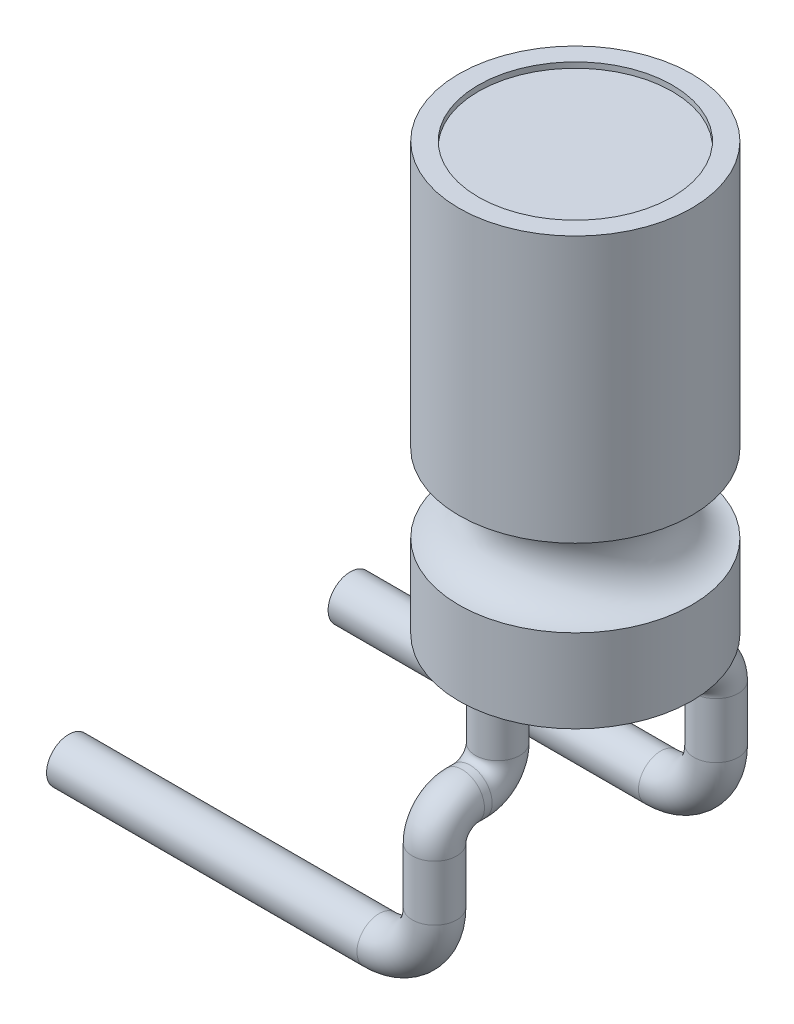
ISO-10303-21;
HEADER;
FILE_DESCRIPTION(('STEP AP214'),'2;1');
FILE_NAME('part.step','',(''),(''),'','','');
FILE_SCHEMA(('AUTOMOTIVE_DESIGN { 1 0 10303 214 1 1 1 1 }'));
ENDSEC;
DATA;
#1=APPLICATION_CONTEXT('core data for automotive mechanical design processes');
#2=APPLICATION_PROTOCOL_DEFINITION('international standard','automotive_design',2000,#1);
#3=PRODUCT_CONTEXT('',#1,'mechanical');
#4=PRODUCT('Part','Part','',(#3));
#5=PRODUCT_RELATED_PRODUCT_CATEGORY('part','',(#4));
#6=PRODUCT_DEFINITION_FORMATION('','',#4);
#7=PRODUCT_DEFINITION_CONTEXT('part definition',#1,'design');
#8=PRODUCT_DEFINITION('design','',#6,#7);
#9=PRODUCT_DEFINITION_SHAPE('','',#8);
#10=(LENGTH_UNIT() NAMED_UNIT(*) SI_UNIT(.MILLI.,.METRE.));
#11=(NAMED_UNIT(*) PLANE_ANGLE_UNIT() SI_UNIT($,.RADIAN.));
#12=(NAMED_UNIT(*) SI_UNIT($,.STERADIAN.) SOLID_ANGLE_UNIT());
#13=UNCERTAINTY_MEASURE_WITH_UNIT(LENGTH_MEASURE(1.E-05),#10,'distance_accuracy_value','');
#14=(GEOMETRIC_REPRESENTATION_CONTEXT(3) GLOBAL_UNCERTAINTY_ASSIGNED_CONTEXT((#13)) GLOBAL_UNIT_ASSIGNED_CONTEXT((#10,
#11,#12)) REPRESENTATION_CONTEXT('',''));
#15=CARTESIAN_POINT('',(0.,0.,0.));
#16=DIRECTION('',(0.,0.,1.));
#17=DIRECTION('',(1.,0.,0.));
#18=AXIS2_PLACEMENT_3D('',#15,#16,#17);
#19=CARTESIAN_POINT('',(2.1,27.5164236634825,0.));
#20=DIRECTION('',(0.,1.,0.));
#21=DIRECTION('',(0.,0.,1.));
#22=AXIS2_PLACEMENT_3D('',#19,#20,#21);
#23=PLANE('',#22);
#24=CARTESIAN_POINT('',(0.,27.5164236634825,-1.4));
#25=DIRECTION('',(0.,1.,0.));
#26=DIRECTION('',(0.,0.,1.));
#27=AXIS2_PLACEMENT_3D('',#24,#25,#26);
#28=CIRCLE('',#27,0.4);
#29=CARTESIAN_POINT('',(0.,27.5164236634825,-1.));
#30=VERTEX_POINT('',#29);
#31=EDGE_CURVE('E88',#30,#30,#28,.T.);
#32=ORIENTED_EDGE('',*,*,#31,.T.);
#33=EDGE_LOOP('',(#32));
#34=FACE_BOUND('',#33,.T.);
#35=CARTESIAN_POINT('',(0.,27.5164236634825,0.));
#36=DIRECTION('',(0.,1.,0.));
#37=DIRECTION('',(0.,0.,1.));
#38=AXIS2_PLACEMENT_3D('',#35,#36,#37);
#39=CIRCLE('',#38,2.1);
#40=CARTESIAN_POINT('',(0.,27.5164236634825,2.1));
#41=VERTEX_POINT('',#40);
#42=EDGE_CURVE('E38',#41,#41,#39,.T.);
#43=ORIENTED_EDGE('',*,*,#42,.F.);
#44=EDGE_LOOP('',(#43));
#45=FACE_BOUND('',#44,.T.);
#46=CARTESIAN_POINT('',(0.,27.5164236634825,1.4));
#47=DIRECTION('',(0.,1.,0.));
#48=DIRECTION('',(0.,0.,1.));
#49=AXIS2_PLACEMENT_3D('',#46,#47,#48);
#50=CIRCLE('',#49,0.4);
#51=CARTESIAN_POINT('',(0.,27.5164236634825,1.8));
#52=VERTEX_POINT('',#51);
#53=EDGE_CURVE('E10',#52,#52,#50,.F.);
#54=ORIENTED_EDGE('',*,*,#53,.F.);
#55=EDGE_LOOP('',(#54));
#56=FACE_BOUND('',#55,.T.);
#57=ADVANCED_FACE('F32',(#34,#45,#56),#23,.F.);
#58=CARTESIAN_POINT('',(0.,48.4017094017094,0.));
#59=DIRECTION('',(0.,1.,0.));
#60=DIRECTION('',(0.,0.,1.));
#61=AXIS2_PLACEMENT_3D('',#58,#59,#60);
#62=CYLINDRICAL_SURFACE('',#61,2.1);
#63=CARTESIAN_POINT('',(0.,29.0164236634825,0.));
#64=DIRECTION('',(0.,1.,0.));
#65=DIRECTION('',(0.,0.,1.));
#66=AXIS2_PLACEMENT_3D('',#63,#64,#65);
#67=CIRCLE('',#66,2.1);
#68=CARTESIAN_POINT('',(0.,29.0164236634825,2.1));
#69=VERTEX_POINT('',#68);
#70=EDGE_CURVE('E42',#69,#69,#67,.T.);
#71=ORIENTED_EDGE('',*,*,#70,.F.);
#72=EDGE_LOOP('',(#71));
#73=FACE_BOUND('',#72,.T.);
#74=ORIENTED_EDGE('',*,*,#42,.T.);
#75=EDGE_LOOP('',(#74));
#76=FACE_BOUND('',#75,.T.);
#77=ADVANCED_FACE('F130',(#73,#76),#62,.T.);
#78=CARTESIAN_POINT('',(0.,29.7164236634825,0.));
#79=DIRECTION('',(0.,1.,0.));
#80=DIRECTION('',(0.,0.,1.));
#81=AXIS2_PLACEMENT_3D('',#78,#79,#80);
#82=TOROIDAL_SURFACE('',#81,2.1,0.699999999999999);
#83=CARTESIAN_POINT('',(0.,30.4164236634825,0.));
#84=DIRECTION('',(0.,1.,0.));
#85=DIRECTION('',(0.,0.,1.));
#86=AXIS2_PLACEMENT_3D('',#83,#84,#85);
#87=CIRCLE('',#86,2.1);
#88=CARTESIAN_POINT('',(0.,30.4164236634825,2.1));
#89=VERTEX_POINT('',#88);
#90=EDGE_CURVE('E46',#89,#89,#87,.T.);
#91=ORIENTED_EDGE('',*,*,#90,.F.);
#92=EDGE_LOOP('',(#91));
#93=FACE_BOUND('',#92,.T.);
#94=ORIENTED_EDGE('',*,*,#70,.T.);
#95=EDGE_LOOP('',(#94));
#96=FACE_BOUND('',#95,.T.);
#97=ADVANCED_FACE('F135',(#93,#96),#82,.F.);
#98=CARTESIAN_POINT('',(0.,48.4017094017094,0.));
#99=DIRECTION('',(0.,1.,0.));
#100=DIRECTION('',(0.,0.,1.));
#101=AXIS2_PLACEMENT_3D('',#98,#99,#100);
#102=CYLINDRICAL_SURFACE('',#101,2.1);
#103=CARTESIAN_POINT('',(0.,35.2164236634825,0.));
#104=DIRECTION('',(0.,1.,0.));
#105=DIRECTION('',(0.,0.,1.));
#106=AXIS2_PLACEMENT_3D('',#103,#104,#105);
#107=CIRCLE('',#106,2.1);
#108=CARTESIAN_POINT('',(0.,35.2164236634825,2.1));
#109=VERTEX_POINT('',#108);
#110=EDGE_CURVE('E51',#109,#109,#107,.T.);
#111=ORIENTED_EDGE('',*,*,#110,.F.);
#112=EDGE_LOOP('',(#111));
#113=FACE_BOUND('',#112,.T.);
#114=ORIENTED_EDGE('',*,*,#90,.T.);
#115=EDGE_LOOP('',(#114));
#116=FACE_BOUND('',#115,.T.);
#117=ADVANCED_FACE('F202',(#113,#116),#102,.T.);
#118=CARTESIAN_POINT('',(0.,35.2164236634825,0.));
#119=DIRECTION('',(0.,-1.,0.));
#120=DIRECTION('',(0.,0.,-1.));
#121=AXIS2_PLACEMENT_3D('',#118,#119,#120);
#122=PLANE('',#121);
#123=CARTESIAN_POINT('',(0.,35.2164236634825,0.));
#124=DIRECTION('',(0.,1.,0.));
#125=DIRECTION('',(0.,0.,1.));
#126=AXIS2_PLACEMENT_3D('',#123,#124,#125);
#127=CIRCLE('',#126,1.75);
#128=CARTESIAN_POINT('',(0.,35.2164236634825,1.75));
#129=VERTEX_POINT('',#128);
#130=EDGE_CURVE('E57',#129,#129,#127,.T.);
#131=ORIENTED_EDGE('',*,*,#130,.F.);
#132=EDGE_LOOP('',(#131));
#133=FACE_BOUND('',#132,.T.);
#134=ORIENTED_EDGE('',*,*,#110,.T.);
#135=EDGE_LOOP('',(#134));
#136=FACE_BOUND('',#135,.T.);
#137=ADVANCED_FACE('F198',(#133,#136),#122,.F.);
#138=CARTESIAN_POINT('',(0.,35.1164236634825,0.));
#139=DIRECTION('',(0.,1.,0.));
#140=DIRECTION('',(0.,0.,1.));
#141=AXIS2_PLACEMENT_3D('',#138,#139,#140);
#142=CYLINDRICAL_SURFACE('',#141,1.75);
#143=CARTESIAN_POINT('',(0.,35.1164236634825,0.));
#144=DIRECTION('',(0.,1.,0.));
#145=DIRECTION('',(0.,0.,1.));
#146=AXIS2_PLACEMENT_3D('',#143,#144,#145);
#147=CIRCLE('',#146,1.75);
#148=CARTESIAN_POINT('',(0.,35.1164236634825,1.75));
#149=VERTEX_POINT('',#148);
#150=EDGE_CURVE('E54',#149,#149,#147,.T.);
#151=ORIENTED_EDGE('',*,*,#150,.F.);
#152=EDGE_LOOP('',(#151));
#153=FACE_BOUND('',#152,.T.);
#154=ORIENTED_EDGE('',*,*,#130,.T.);
#155=EDGE_LOOP('',(#154));
#156=FACE_BOUND('',#155,.T.);
#157=ADVANCED_FACE('F194',(#153,#156),#142,.F.);
#158=CARTESIAN_POINT('',(0.,35.1164236634825,0.));
#159=DIRECTION('',(0.,1.,0.));
#160=DIRECTION('',(0.,0.,1.));
#161=AXIS2_PLACEMENT_3D('',#158,#159,#160);
#162=PLANE('',#161);
#163=ORIENTED_EDGE('',*,*,#150,.T.);
#164=EDGE_LOOP('',(#163));
#165=FACE_BOUND('',#164,.T.);
#166=ADVANCED_FACE('F190',(#165),#162,.T.);
#167=CARTESIAN_POINT('',(0.,25.5164236634825,2.04));
#168=DIRECTION('',(1.,0.,0.));
#169=DIRECTION('',(0.,0.,-1.));
#170=AXIS2_PLACEMENT_3D('',#167,#168,#169);
#171=TOROIDAL_SURFACE('',#170,0.500000000000004,0.4);
#172=CARTESIAN_POINT('',(0.,26.0164236634825,2.04));
#173=DIRECTION('',(0.,0.,1.));
#174=DIRECTION('',(0.,-1.,0.));
#175=AXIS2_PLACEMENT_3D('',#172,#173,#174);
#176=CIRCLE('',#175,0.4);
#177=CARTESIAN_POINT('',(0.,26.4164236634825,2.03999999999999));
#178=VERTEX_POINT('',#177);
#179=EDGE_CURVE('E63',#178,#178,#176,.T.);
#180=CARTESIAN_POINT('',(0.,25.5164236634825,2.54));
#181=DIRECTION('',(0.,-1.,0.));
#182=DIRECTION('',(0.,0.,-1.));
#183=AXIS2_PLACEMENT_3D('',#180,#181,#182);
#184=CIRCLE('',#183,0.4);
#185=CARTESIAN_POINT('',(0.,25.5164236634825,2.94));
#186=VERTEX_POINT('',#185);
#187=EDGE_CURVE('E60',#186,#186,#184,.T.);
#188=CARTESIAN_POINT('',(0.,25.5164236634825,2.04));
#189=DIRECTION('',(1.,0.,0.));
#190=DIRECTION('',(0.,0.,-1.));
#191=AXIS2_PLACEMENT_3D('',#188,#189,#190);
#192=CIRCLE('',#191,0.900000000000004);
#193=EDGE_CURVE('',#178,#186,#192,.T.);
#194=ORIENTED_EDGE('',*,*,#179,.T.);
#195=ORIENTED_EDGE('',*,*,#187,.F.);
#196=ORIENTED_EDGE('',*,*,#193,.T.);
#197=ORIENTED_EDGE('',*,*,#193,.F.);
#198=EDGE_LOOP('',(#194,#196,#195,#197));
#199=FACE_BOUND('',#198,.T.);
#200=ADVANCED_FACE('F186',(#199),#171,.T.);
#201=CARTESIAN_POINT('',(0.,26.0164236634825,1.9));
#202=DIRECTION('',(0.,0.,1.));
#203=DIRECTION('',(1.,0.,0.));
#204=AXIS2_PLACEMENT_3D('',#201,#202,#203);
#205=CYLINDRICAL_SURFACE('',#204,0.4);
#206=CARTESIAN_POINT('',(0.,26.0164236634825,1.9));
#207=DIRECTION('',(0.,0.,1.));
#208=DIRECTION('',(0.,-1.,0.));
#209=AXIS2_PLACEMENT_3D('',#206,#207,#208);
#210=CIRCLE('',#209,0.4);
#211=CARTESIAN_POINT('',(0.,25.6164236634825,1.9));
#212=VERTEX_POINT('',#211);
#213=EDGE_CURVE('E66',#212,#212,#210,.T.);
#214=ORIENTED_EDGE('',*,*,#213,.T.);
#215=EDGE_LOOP('',(#214));
#216=FACE_BOUND('',#215,.T.);
#217=ORIENTED_EDGE('',*,*,#179,.F.);
#218=EDGE_LOOP('',(#217));
#219=FACE_BOUND('',#218,.T.);
#220=ADVANCED_FACE('F182',(#216,#219),#205,.T.);
#221=CARTESIAN_POINT('',(0.,26.5164236634825,1.9));
#222=DIRECTION('',(-1.,0.,0.));
#223=DIRECTION('',(0.,0.,1.));
#224=AXIS2_PLACEMENT_3D('',#221,#222,#223);
#225=TOROIDAL_SURFACE('',#224,0.5,0.4);
#226=CARTESIAN_POINT('',(0.,26.5164236634825,1.4));
#227=DIRECTION('',(0.,-1.,0.));
#228=DIRECTION('',(0.,0.,-1.));
#229=AXIS2_PLACEMENT_3D('',#226,#227,#228);
#230=CIRCLE('',#229,0.4);
#231=CARTESIAN_POINT('',(0.,26.5164236634825,1.));
#232=VERTEX_POINT('',#231);
#233=EDGE_CURVE('E69',#232,#232,#230,.T.);
#234=CARTESIAN_POINT('',(0.,26.5164236634825,1.9));
#235=DIRECTION('',(-1.,0.,0.));
#236=DIRECTION('',(0.,0.,1.));
#237=AXIS2_PLACEMENT_3D('',#234,#235,#236);
#238=CIRCLE('',#237,0.9);
#239=EDGE_CURVE('',#232,#212,#238,.T.);
#240=ORIENTED_EDGE('',*,*,#233,.T.);
#241=ORIENTED_EDGE('',*,*,#213,.F.);
#242=ORIENTED_EDGE('',*,*,#239,.T.);
#243=ORIENTED_EDGE('',*,*,#239,.F.);
#244=EDGE_LOOP('',(#240,#242,#241,#243));
#245=FACE_BOUND('',#244,.T.);
#246=ADVANCED_FACE('F178',(#245),#225,.T.);
#247=CARTESIAN_POINT('',(0.,26.5164236634825,1.4));
#248=DIRECTION('',(0.,1.,0.));
#249=DIRECTION('',(0.,0.,1.));
#250=AXIS2_PLACEMENT_3D('',#247,#248,#249);
#251=CYLINDRICAL_SURFACE('',#250,0.4);
#252=ORIENTED_EDGE('',*,*,#233,.F.);
#253=EDGE_LOOP('',(#252));
#254=FACE_BOUND('',#253,.T.);
#255=ORIENTED_EDGE('',*,*,#53,.T.);
#256=EDGE_LOOP('',(#255));
#257=FACE_BOUND('',#256,.T.);
#258=ADVANCED_FACE('F174',(#254,#257),#251,.T.);
#259=CARTESIAN_POINT('',(-1.,23.5164236634825,2.54));
#260=DIRECTION('',(-1.,0.,0.));
#261=DIRECTION('',(0.,0.,1.));
#262=AXIS2_PLACEMENT_3D('',#259,#260,#261);
#263=CYLINDRICAL_SURFACE('',#262,0.4);
#264=CARTESIAN_POINT('',(-1.,23.5164236634825,2.54));
#265=DIRECTION('',(-1.,0.,0.));
#266=DIRECTION('',(0.,0.,-1.));
#267=AXIS2_PLACEMENT_3D('',#264,#265,#266);
#268=CIRCLE('',#267,0.4);
#269=CARTESIAN_POINT('',(-1.,23.1164236634825,2.54));
#270=VERTEX_POINT('',#269);
#271=EDGE_CURVE('E75',#270,#270,#268,.T.);
#272=ORIENTED_EDGE('',*,*,#271,.T.);
#273=EDGE_LOOP('',(#272));
#274=FACE_BOUND('',#273,.T.);
#275=CARTESIAN_POINT('',(-6.6,23.5164236634825,2.54));
#276=DIRECTION('',(-1.,0.,0.));
#277=DIRECTION('',(0.,0.,-1.));
#278=AXIS2_PLACEMENT_3D('',#275,#276,#277);
#279=CIRCLE('',#278,0.4);
#280=CARTESIAN_POINT('',(-6.6,23.5164236634825,2.14));
#281=VERTEX_POINT('',#280);
#282=EDGE_CURVE('E72',#281,#281,#279,.T.);
#283=ORIENTED_EDGE('',*,*,#282,.F.);
#284=EDGE_LOOP('',(#283));
#285=FACE_BOUND('',#284,.T.);
#286=ADVANCED_FACE('F170',(#274,#285),#263,.T.);
#287=CARTESIAN_POINT('',(-1.,24.5164236634825,2.54));
#288=DIRECTION('',(0.,0.,-1.));
#289=DIRECTION('',(-1.,0.,0.));
#290=AXIS2_PLACEMENT_3D('',#287,#288,#289);
#291=TOROIDAL_SURFACE('',#290,1.,0.4);
#292=CARTESIAN_POINT('',(0.,24.5164236634825,2.54));
#293=DIRECTION('',(0.,-1.,0.));
#294=DIRECTION('',(0.,0.,-1.));
#295=AXIS2_PLACEMENT_3D('',#292,#293,#294);
#296=CIRCLE('',#295,0.4);
#297=CARTESIAN_POINT('',(0.4,24.5164236634825,2.54));
#298=VERTEX_POINT('',#297);
#299=EDGE_CURVE('E78',#298,#298,#296,.T.);
#300=CARTESIAN_POINT('',(-1.,24.5164236634825,2.54));
#301=DIRECTION('',(0.,0.,-1.));
#302=DIRECTION('',(-1.,0.,0.));
#303=AXIS2_PLACEMENT_3D('',#300,#301,#302);
#304=CIRCLE('',#303,1.4);
#305=EDGE_CURVE('',#298,#270,#304,.T.);
#306=ORIENTED_EDGE('',*,*,#299,.T.);
#307=ORIENTED_EDGE('',*,*,#271,.F.);
#308=ORIENTED_EDGE('',*,*,#305,.T.);
#309=ORIENTED_EDGE('',*,*,#305,.F.);
#310=EDGE_LOOP('',(#306,#308,#307,#309));
#311=FACE_BOUND('',#310,.T.);
#312=ADVANCED_FACE('F166',(#311),#291,.T.);
#313=CARTESIAN_POINT('',(0.,24.5164236634825,2.54));
#314=DIRECTION('',(0.,1.,0.));
#315=DIRECTION('',(0.,0.,1.));
#316=AXIS2_PLACEMENT_3D('',#313,#314,#315);
#317=CYLINDRICAL_SURFACE('',#316,0.4);
#318=ORIENTED_EDGE('',*,*,#299,.F.);
#319=EDGE_LOOP('',(#318));
#320=FACE_BOUND('',#319,.T.);
#321=ORIENTED_EDGE('',*,*,#187,.T.);
#322=EDGE_LOOP('',(#321));
#323=FACE_BOUND('',#322,.T.);
#324=ADVANCED_FACE('F162',(#320,#323),#317,.T.);
#325=CARTESIAN_POINT('',(-6.6,23.5164236634825,2.54));
#326=DIRECTION('',(-1.,0.,0.));
#327=DIRECTION('',(0.,0.,-1.));
#328=AXIS2_PLACEMENT_3D('',#325,#326,#327);
#329=PLANE('',#328);
#330=ORIENTED_EDGE('',*,*,#282,.T.);
#331=EDGE_LOOP('',(#330));
#332=FACE_BOUND('',#331,.T.);
#333=ADVANCED_FACE('F158',(#332),#329,.T.);
#334=CARTESIAN_POINT('',(0.,25.5164236634825,-2.04));
#335=DIRECTION('',(-1.,0.,0.));
#336=DIRECTION('',(0.,0.,1.));
#337=AXIS2_PLACEMENT_3D('',#334,#335,#336);
#338=TOROIDAL_SURFACE('',#337,0.500000000000004,0.4);
#339=CARTESIAN_POINT('',(0.,26.0164236634825,-2.04));
#340=DIRECTION('',(0.,0.,1.));
#341=DIRECTION('',(0.,-1.,0.));
#342=AXIS2_PLACEMENT_3D('',#339,#340,#341);
#343=CIRCLE('',#342,0.4);
#344=CARTESIAN_POINT('',(0.,26.4164236634825,-2.03999999999999));
#345=VERTEX_POINT('',#344);
#346=EDGE_CURVE('E81',#345,#345,#343,.T.);
#347=CARTESIAN_POINT('',(0.,25.5164236634825,-2.54));
#348=DIRECTION('',(0.,1.,0.));
#349=DIRECTION('',(0.,0.,1.));
#350=AXIS2_PLACEMENT_3D('',#347,#348,#349);
#351=CIRCLE('',#350,0.4);
#352=CARTESIAN_POINT('',(0.,25.5164236634825,-2.94));
#353=VERTEX_POINT('',#352);
#354=EDGE_CURVE('E100',#353,#353,#351,.T.);
#355=CARTESIAN_POINT('',(0.,25.5164236634825,-2.04));
#356=DIRECTION('',(-1.,0.,0.));
#357=DIRECTION('',(0.,0.,1.));
#358=AXIS2_PLACEMENT_3D('',#355,#356,#357);
#359=CIRCLE('',#358,0.900000000000004);
#360=EDGE_CURVE('',#345,#353,#359,.T.);
#361=ORIENTED_EDGE('',*,*,#346,.F.);
#362=ORIENTED_EDGE('',*,*,#354,.T.);
#363=ORIENTED_EDGE('',*,*,#360,.T.);
#364=ORIENTED_EDGE('',*,*,#360,.F.);
#365=EDGE_LOOP('',(#361,#363,#362,#364));
#366=FACE_BOUND('',#365,.T.);
#367=ADVANCED_FACE('F154',(#366),#338,.T.);
#368=CARTESIAN_POINT('',(0.,26.0164236634825,-1.9));
#369=DIRECTION('',(0.,0.,-1.));
#370=DIRECTION('',(-1.,0.,0.));
#371=AXIS2_PLACEMENT_3D('',#368,#369,#370);
#372=CYLINDRICAL_SURFACE('',#371,0.4);
#373=CARTESIAN_POINT('',(0.,26.0164236634825,-1.9));
#374=DIRECTION('',(0.,0.,1.));
#375=DIRECTION('',(0.,-1.,0.));
#376=AXIS2_PLACEMENT_3D('',#373,#374,#375);
#377=CIRCLE('',#376,0.4);
#378=CARTESIAN_POINT('',(0.,25.6164236634825,-1.9));
#379=VERTEX_POINT('',#378);
#380=EDGE_CURVE('E84',#379,#379,#377,.T.);
#381=ORIENTED_EDGE('',*,*,#380,.F.);
#382=EDGE_LOOP('',(#381));
#383=FACE_BOUND('',#382,.T.);
#384=ORIENTED_EDGE('',*,*,#346,.T.);
#385=EDGE_LOOP('',(#384));
#386=FACE_BOUND('',#385,.T.);
#387=ADVANCED_FACE('F148',(#383,#386),#372,.T.);
#388=CARTESIAN_POINT('',(0.,26.5164236634825,-1.9));
#389=DIRECTION('',(1.,0.,0.));
#390=DIRECTION('',(0.,0.,-1.));
#391=AXIS2_PLACEMENT_3D('',#388,#389,#390);
#392=TOROIDAL_SURFACE('',#391,0.5,0.4);
#393=CARTESIAN_POINT('',(0.,26.5164236634825,-1.4));
#394=DIRECTION('',(0.,1.,0.));
#395=DIRECTION('',(0.,0.,1.));
#396=AXIS2_PLACEMENT_3D('',#393,#394,#395);
#397=CIRCLE('',#396,0.4);
#398=CARTESIAN_POINT('',(0.,26.5164236634825,-1.));
#399=VERTEX_POINT('',#398);
#400=EDGE_CURVE('E87',#399,#399,#397,.T.);
#401=CARTESIAN_POINT('',(0.,26.5164236634825,-1.9));
#402=DIRECTION('',(1.,0.,0.));
#403=DIRECTION('',(0.,0.,-1.));
#404=AXIS2_PLACEMENT_3D('',#401,#402,#403);
#405=CIRCLE('',#404,0.9);
#406=EDGE_CURVE('',#399,#379,#405,.T.);
#407=ORIENTED_EDGE('',*,*,#400,.F.);
#408=ORIENTED_EDGE('',*,*,#380,.T.);
#409=ORIENTED_EDGE('',*,*,#406,.T.);
#410=ORIENTED_EDGE('',*,*,#406,.F.);
#411=EDGE_LOOP('',(#407,#409,#408,#410));
#412=FACE_BOUND('',#411,.T.);
#413=ADVANCED_FACE('F142',(#412),#392,.T.);
#414=CARTESIAN_POINT('',(0.,26.5164236634825,-1.4));
#415=DIRECTION('',(0.,1.,0.));
#416=DIRECTION('',(0.,0.,1.));
#417=AXIS2_PLACEMENT_3D('',#414,#415,#416);
#418=CYLINDRICAL_SURFACE('',#417,0.4);
#419=ORIENTED_EDGE('',*,*,#400,.T.);
#420=EDGE_LOOP('',(#419));
#421=FACE_BOUND('',#420,.T.);
#422=ORIENTED_EDGE('',*,*,#31,.F.);
#423=EDGE_LOOP('',(#422));
#424=FACE_BOUND('',#423,.T.);
#425=ADVANCED_FACE('F118',(#421,#424),#418,.T.);
#426=CARTESIAN_POINT('',(-1.,23.5164236634825,-2.54));
#427=DIRECTION('',(-1.,0.,0.));
#428=DIRECTION('',(0.,0.,1.));
#429=AXIS2_PLACEMENT_3D('',#426,#427,#428);
#430=CYLINDRICAL_SURFACE('',#429,0.4);
#431=CARTESIAN_POINT('',(-1.,23.5164236634825,-2.54));
#432=DIRECTION('',(1.,0.,0.));
#433=DIRECTION('',(0.,0.,1.));
#434=AXIS2_PLACEMENT_3D('',#431,#432,#433);
#435=CIRCLE('',#434,0.4);
#436=CARTESIAN_POINT('',(-1.,23.1164236634825,-2.54));
#437=VERTEX_POINT('',#436);
#438=EDGE_CURVE('E96',#437,#437,#435,.T.);
#439=ORIENTED_EDGE('',*,*,#438,.F.);
#440=EDGE_LOOP('',(#439));
#441=FACE_BOUND('',#440,.T.);
#442=CARTESIAN_POINT('',(-6.6,23.5164236634825,-2.54));
#443=DIRECTION('',(1.,0.,0.));
#444=DIRECTION('',(0.,0.,1.));
#445=AXIS2_PLACEMENT_3D('',#442,#443,#444);
#446=CIRCLE('',#445,0.4);
#447=CARTESIAN_POINT('',(-6.6,23.5164236634825,-2.14));
#448=VERTEX_POINT('',#447);
#449=EDGE_CURVE('E91',#448,#448,#446,.T.);
#450=ORIENTED_EDGE('',*,*,#449,.T.);
#451=EDGE_LOOP('',(#450));
#452=FACE_BOUND('',#451,.T.);
#453=ADVANCED_FACE('F112',(#441,#452),#430,.T.);
#454=CARTESIAN_POINT('',(-1.,24.5164236634825,-2.54));
#455=DIRECTION('',(0.,0.,-1.));
#456=DIRECTION('',(-1.,0.,0.));
#457=AXIS2_PLACEMENT_3D('',#454,#455,#456);
#458=TOROIDAL_SURFACE('',#457,1.,0.4);
#459=CARTESIAN_POINT('',(0.,24.5164236634825,-2.54));
#460=DIRECTION('',(0.,1.,0.));
#461=DIRECTION('',(0.,0.,1.));
#462=AXIS2_PLACEMENT_3D('',#459,#460,#461);
#463=CIRCLE('',#462,0.4);
#464=CARTESIAN_POINT('',(0.4,24.5164236634825,-2.54));
#465=VERTEX_POINT('',#464);
#466=EDGE_CURVE('E99',#465,#465,#463,.T.);
#467=CARTESIAN_POINT('',(-1.,24.5164236634825,-2.54));
#468=DIRECTION('',(0.,0.,-1.));
#469=DIRECTION('',(-1.,0.,0.));
#470=AXIS2_PLACEMENT_3D('',#467,#468,#469);
#471=CIRCLE('',#470,1.4);
#472=EDGE_CURVE('',#465,#437,#471,.T.);
#473=ORIENTED_EDGE('',*,*,#466,.F.);
#474=ORIENTED_EDGE('',*,*,#438,.T.);
#475=ORIENTED_EDGE('',*,*,#472,.T.);
#476=ORIENTED_EDGE('',*,*,#472,.F.);
#477=EDGE_LOOP('',(#473,#475,#474,#476));
#478=FACE_BOUND('',#477,.T.);
#479=ADVANCED_FACE('F109',(#478),#458,.T.);
#480=CARTESIAN_POINT('',(0.,24.5164236634825,-2.54));
#481=DIRECTION('',(0.,1.,0.));
#482=DIRECTION('',(0.,0.,1.));
#483=AXIS2_PLACEMENT_3D('',#480,#481,#482);
#484=CYLINDRICAL_SURFACE('',#483,0.4);
#485=ORIENTED_EDGE('',*,*,#466,.T.);
#486=EDGE_LOOP('',(#485));
#487=FACE_BOUND('',#486,.T.);
#488=ORIENTED_EDGE('',*,*,#354,.F.);
#489=EDGE_LOOP('',(#488));
#490=FACE_BOUND('',#489,.T.);
#491=ADVANCED_FACE('F106',(#487,#490),#484,.T.);
#492=CARTESIAN_POINT('',(-6.6,23.5164236634825,-2.54));
#493=DIRECTION('',(-1.,0.,0.));
#494=DIRECTION('',(0.,0.,1.));
#495=AXIS2_PLACEMENT_3D('',#492,#493,#494);
#496=PLANE('',#495);
#497=ORIENTED_EDGE('',*,*,#449,.F.);
#498=EDGE_LOOP('',(#497));
#499=FACE_BOUND('',#498,.T.);
#500=ADVANCED_FACE('F122',(#499),#496,.T.);
#501=CLOSED_SHELL('',(#57,#77,#97,#117,#137,#157,#166,#200,#220,#246,#258,#286,#312,#324,#333,
#367,#387,#413,#425,#453,#479,#491,#500));
#502=MANIFOLD_SOLID_BREP('B2',#501);
#503=ADVANCED_BREP_SHAPE_REPRESENTATION('',(#18,#502),#14);
#504=SHAPE_DEFINITION_REPRESENTATION(#9,#503);
ENDSEC;
END-ISO-10303-21;
